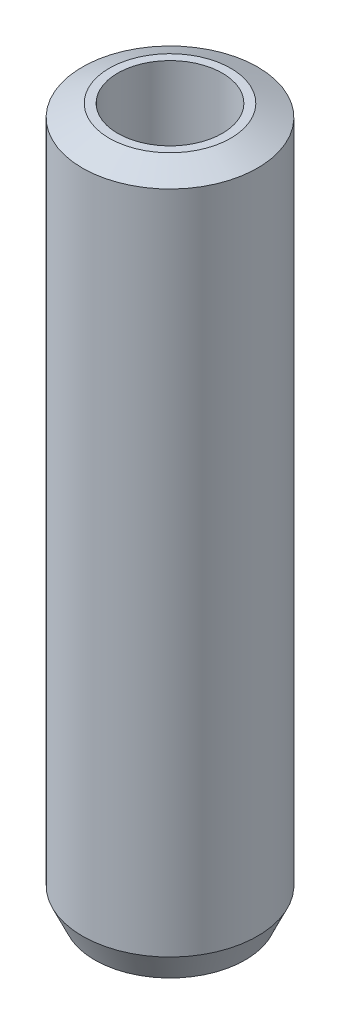
ISO-10303-21;
HEADER;
FILE_DESCRIPTION(('STEP AP214'),'2;1');
FILE_NAME('part.step','',(''),(''),'','','');
FILE_SCHEMA(('AUTOMOTIVE_DESIGN { 1 0 10303 214 1 1 1 1 }'));
ENDSEC;
DATA;
#1=APPLICATION_CONTEXT('core data for automotive mechanical design processes');
#2=APPLICATION_PROTOCOL_DEFINITION('international standard','automotive_design',2000,#1);
#3=PRODUCT_CONTEXT('',#1,'mechanical');
#4=PRODUCT('Part','Part','',(#3));
#5=PRODUCT_RELATED_PRODUCT_CATEGORY('part','',(#4));
#6=PRODUCT_DEFINITION_FORMATION('','',#4);
#7=PRODUCT_DEFINITION_CONTEXT('part definition',#1,'design');
#8=PRODUCT_DEFINITION('design','',#6,#7);
#9=PRODUCT_DEFINITION_SHAPE('','',#8);
#10=(LENGTH_UNIT() NAMED_UNIT(*) SI_UNIT(.MILLI.,.METRE.));
#11=(NAMED_UNIT(*) PLANE_ANGLE_UNIT() SI_UNIT($,.RADIAN.));
#12=(NAMED_UNIT(*) SI_UNIT($,.STERADIAN.) SOLID_ANGLE_UNIT());
#13=UNCERTAINTY_MEASURE_WITH_UNIT(LENGTH_MEASURE(1.E-05),#10,'distance_accuracy_value','');
#14=(GEOMETRIC_REPRESENTATION_CONTEXT(3) GLOBAL_UNCERTAINTY_ASSIGNED_CONTEXT((#13)) GLOBAL_UNIT_ASSIGNED_CONTEXT((#10,
#11,#12)) REPRESENTATION_CONTEXT('',''));
#15=CARTESIAN_POINT('',(0.,0.,0.));
#16=DIRECTION('',(0.,0.,1.));
#17=DIRECTION('',(1.,0.,0.));
#18=AXIS2_PLACEMENT_3D('',#15,#16,#17);
#19=CARTESIAN_POINT('',(0.,301.515304557621,0.));
#20=DIRECTION('',(0.,-1.,0.));
#21=DIRECTION('',(0.,0.,-1.));
#22=AXIS2_PLACEMENT_3D('',#19,#20,#21);
#23=CYLINDRICAL_SURFACE('',#22,37.5);
#24=CARTESIAN_POINT('',(0.,296.228267570941,0.));
#25=DIRECTION('',(0.,1.,0.));
#26=DIRECTION('',(0.,0.,1.));
#27=AXIS2_PLACEMENT_3D('',#24,#25,#26);
#28=CIRCLE('',#27,37.5);
#29=CARTESIAN_POINT('',(0.,296.228267570941,37.5));
#30=VERTEX_POINT('',#29);
#31=EDGE_CURVE('E50',#30,#30,#28,.F.);
#32=ORIENTED_EDGE('',*,*,#31,.T.);
#33=EDGE_LOOP('',(#32));
#34=FACE_BOUND('',#33,.T.);
#35=CARTESIAN_POINT('',(0.,11.516406954369,0.));
#36=DIRECTION('',(0.,1.,0.));
#37=DIRECTION('',(0.,0.,1.));
#38=AXIS2_PLACEMENT_3D('',#35,#36,#37);
#39=CIRCLE('',#38,37.5);
#40=CARTESIAN_POINT('',(0.,11.516406954369,37.5));
#41=VERTEX_POINT('',#40);
#42=EDGE_CURVE('E51',#41,#41,#39,.T.);
#43=ORIENTED_EDGE('',*,*,#42,.T.);
#44=EDGE_LOOP('',(#43));
#45=FACE_BOUND('',#44,.T.);
#46=ADVANCED_FACE('F39',(#34,#45),#23,.T.);
#47=CARTESIAN_POINT('',(0.,301.515304557621,0.));
#48=DIRECTION('',(0.,1.,0.));
#49=DIRECTION('',(0.,0.,1.));
#50=AXIS2_PLACEMENT_3D('',#47,#48,#49);
#51=PLANE('',#50);
#52=CARTESIAN_POINT('',(0.,301.515304557621,0.));
#53=DIRECTION('',(0.,1.,0.));
#54=DIRECTION('',(0.,0.,1.));
#55=AXIS2_PLACEMENT_3D('',#52,#53,#54);
#56=CIRCLE('',#55,25.9835930456313);
#57=CARTESIAN_POINT('',(0.,301.515304557621,25.9835930456313));
#58=VERTEX_POINT('',#57);
#59=EDGE_CURVE('E54',#58,#58,#56,.T.);
#60=ORIENTED_EDGE('',*,*,#59,.T.);
#61=EDGE_LOOP('',(#60));
#62=FACE_BOUND('',#61,.T.);
#63=CARTESIAN_POINT('',(0.,301.515304557621,0.));
#64=DIRECTION('',(0.,1.,0.));
#65=DIRECTION('',(0.,0.,1.));
#66=AXIS2_PLACEMENT_3D('',#63,#64,#65);
#67=CIRCLE('',#66,22.3755580265607);
#68=CARTESIAN_POINT('',(0.,301.515304557621,22.3755580265607));
#69=VERTEX_POINT('',#68);
#70=EDGE_CURVE('E58',#69,#69,#67,.T.);
#71=ORIENTED_EDGE('',*,*,#70,.F.);
#72=EDGE_LOOP('',(#71));
#73=FACE_BOUND('',#72,.T.);
#74=ADVANCED_FACE('F69',(#62,#73),#51,.T.);
#75=CARTESIAN_POINT('',(0.,0.,0.));
#76=DIRECTION('',(0.,1.,0.));
#77=DIRECTION('',(0.,0.,1.));
#78=AXIS2_PLACEMENT_3D('',#75,#76,#77);
#79=PLANE('',#78);
#80=CARTESIAN_POINT('',(0.,0.,0.));
#81=DIRECTION('',(0.,1.,0.));
#82=DIRECTION('',(0.,0.,1.));
#83=AXIS2_PLACEMENT_3D('',#80,#81,#82);
#84=CIRCLE('',#83,32.2129630133191);
#85=CARTESIAN_POINT('',(0.,0.,32.2129630133191));
#86=VERTEX_POINT('',#85);
#87=EDGE_CURVE('E10',#86,#86,#84,.F.);
#88=ORIENTED_EDGE('',*,*,#87,.T.);
#89=EDGE_LOOP('',(#88));
#90=FACE_BOUND('',#89,.T.);
#91=CARTESIAN_POINT('',(0.,0.,0.));
#92=DIRECTION('',(0.,1.,0.));
#93=DIRECTION('',(0.,0.,1.));
#94=AXIS2_PLACEMENT_3D('',#91,#92,#93);
#95=CIRCLE('',#94,22.3755580265607);
#96=CARTESIAN_POINT('',(0.,0.,22.3755580265607));
#97=VERTEX_POINT('',#96);
#98=EDGE_CURVE('E63',#97,#97,#95,.T.);
#99=ORIENTED_EDGE('',*,*,#98,.T.);
#100=EDGE_LOOP('',(#99));
#101=FACE_BOUND('',#100,.T.);
#102=ADVANCED_FACE('F75',(#90,#101),#79,.F.);
#103=CARTESIAN_POINT('',(0.,301.515304557621,0.));
#104=DIRECTION('',(0.,-1.,0.));
#105=DIRECTION('',(0.,0.,-1.));
#106=AXIS2_PLACEMENT_3D('',#103,#104,#105);
#107=CYLINDRICAL_SURFACE('',#106,22.3755580265607);
#108=ORIENTED_EDGE('',*,*,#70,.T.);
#109=EDGE_LOOP('',(#108));
#110=FACE_BOUND('',#109,.T.);
#111=ORIENTED_EDGE('',*,*,#98,.F.);
#112=EDGE_LOOP('',(#111));
#113=FACE_BOUND('',#112,.T.);
#114=ADVANCED_FACE('F70',(#110,#113),#107,.F.);
#115=CARTESIAN_POINT('',(0.,301.515304557621,0.));
#116=DIRECTION('',(0.,-1.,0.));
#117=DIRECTION('',(0.,0.,-1.));
#118=AXIS2_PLACEMENT_3D('',#115,#116,#117);
#119=CONICAL_SURFACE('',#118,25.9835930456313,1.14041109022064);
#120=ORIENTED_EDGE('',*,*,#31,.F.);
#121=EDGE_LOOP('',(#120));
#122=FACE_BOUND('',#121,.T.);
#123=ORIENTED_EDGE('',*,*,#59,.F.);
#124=EDGE_LOOP('',(#123));
#125=FACE_BOUND('',#124,.T.);
#126=ADVANCED_FACE('F81',(#122,#125),#119,.T.);
#127=CARTESIAN_POINT('',(0.,11.516406954369,0.));
#128=DIRECTION('',(0.,1.,0.));
#129=DIRECTION('',(0.,0.,1.));
#130=AXIS2_PLACEMENT_3D('',#127,#128,#129);
#131=CONICAL_SURFACE('',#130,37.5,0.430385236574257);
#132=CARTESIAN_POINT('',(0.,0.,32.2129630133191));
#133=CARTESIAN_POINT('',(0.,0.119962572441342,32.2680363152637));
#134=CARTESIAN_POINT('',(0.,0.239925144882686,32.3231096172083));
#135=CARTESIAN_POINT('',(0.,0.479850289765374,32.4332562210975));
#136=CARTESIAN_POINT('',(0.,0.599812862206717,32.4883295230421));
#137=CARTESIAN_POINT('',(0.,0.839738007089405,32.5984761269313));
#138=CARTESIAN_POINT('',(0.,0.959700579530749,32.6535494288759));
#139=CARTESIAN_POINT('',(0.,1.19962572441344,32.7636960327651));
#140=CARTESIAN_POINT('',(0.,1.31958829685478,32.8187693347097));
#141=CARTESIAN_POINT('',(0.,1.55951344173747,32.9289159385988));
#142=CARTESIAN_POINT('',(0.,1.67947601417881,32.9839892405434));
#143=CARTESIAN_POINT('',(0.,1.9194011590615,33.0941358444326));
#144=CARTESIAN_POINT('',(0.,2.03936373150284,33.1492091463772));
#145=CARTESIAN_POINT('',(0.,2.27928887638553,33.2593557502664));
#146=CARTESIAN_POINT('',(0.,2.39925144882688,33.314429052211));
#147=CARTESIAN_POINT('',(0.,2.63917659370956,33.4245756561002));
#148=CARTESIAN_POINT('',(0.,2.75913916615091,33.4796489580448));
#149=CARTESIAN_POINT('',(0.,2.99906431103359,33.5897955619339));
#150=CARTESIAN_POINT('',(0.,3.11902688347494,33.6448688638785));
#151=CARTESIAN_POINT('',(0.,3.35895202835763,33.7550154677677));
#152=CARTESIAN_POINT('',(0.,3.47891460079897,33.8100887697123));
#153=CARTESIAN_POINT('',(0.,3.71883974568166,33.9202353736015));
#154=CARTESIAN_POINT('',(0.,3.838802318123,33.9753086755461));
#155=CARTESIAN_POINT('',(0.,4.07872746300569,34.0854552794353));
#156=CARTESIAN_POINT('',(0.,4.19869003544703,34.1405285813799));
#157=CARTESIAN_POINT('',(0.,4.43861518032972,34.2506751852691));
#158=CARTESIAN_POINT('',(0.,4.55857775277106,34.3057484872136));
#159=CARTESIAN_POINT('',(0.,4.79850289765375,34.4158950911028));
#160=CARTESIAN_POINT('',(0.,4.9184654700951,34.4709683930474));
#161=CARTESIAN_POINT('',(0.,5.15839061497778,34.5811149969366));
#162=CARTESIAN_POINT('',(0.,5.27835318741913,34.6361882988812));
#163=CARTESIAN_POINT('',(0.,5.51827833230181,34.7463349027704));
#164=CARTESIAN_POINT('',(0.,5.63824090474316,34.801408204715));
#165=CARTESIAN_POINT('',(0.,5.87816604962585,34.9115548086042));
#166=CARTESIAN_POINT('',(0.,5.99812862206719,34.9666281105488));
#167=CARTESIAN_POINT('',(0.,6.23805376694988,35.0767747144379));
#168=CARTESIAN_POINT('',(0.,6.35801633939122,35.1318480163825));
#169=CARTESIAN_POINT('',(0.,6.59794148427391,35.2419946202717));
#170=CARTESIAN_POINT('',(0.,6.71790405671525,35.2970679222163));
#171=CARTESIAN_POINT('',(0.,6.95782920159794,35.4072145261055));
#172=CARTESIAN_POINT('',(0.,7.07779177403928,35.4622878280501));
#173=CARTESIAN_POINT('',(0.,7.31771691892197,35.5724344319393));
#174=CARTESIAN_POINT('',(0.,7.43767949136332,35.6275077338839));
#175=CARTESIAN_POINT('',(0.,7.677604636246,35.737654337773));
#176=CARTESIAN_POINT('',(0.,7.79756720868735,35.7927276397176));
#177=CARTESIAN_POINT('',(0.,8.03749235357003,35.9028742436068));
#178=CARTESIAN_POINT('',(0.,8.15745492601138,35.9579475455514));
#179=CARTESIAN_POINT('',(0.,8.39738007089407,36.0680941494406));
#180=CARTESIAN_POINT('',(0.,8.51734264333541,36.1231674513852));
#181=CARTESIAN_POINT('',(0.,8.7572677882181,36.2333140552744));
#182=CARTESIAN_POINT('',(0.,8.87723036065944,36.288387357219));
#183=CARTESIAN_POINT('',(0.,9.11715550554213,36.3985339611082));
#184=CARTESIAN_POINT('',(0.,9.23711807798347,36.4536072630528));
#185=CARTESIAN_POINT('',(0.,9.47704322286616,36.5637538669419));
#186=CARTESIAN_POINT('',(0.,9.59700579530751,36.6188271688865));
#187=CARTESIAN_POINT('',(0.,9.83693094019019,36.7289737727757));
#188=CARTESIAN_POINT('',(0.,9.95689351263154,36.7840470747203));
#189=CARTESIAN_POINT('',(0.,10.1968186575142,36.8941936786095));
#190=CARTESIAN_POINT('',(0.,10.3167812299556,36.9492669805541));
#191=CARTESIAN_POINT('',(0.,10.5567063748383,37.0594135844433));
#192=CARTESIAN_POINT('',(0.,10.6766689472796,37.1144868863879));
#193=CARTESIAN_POINT('',(0.,10.9165940921623,37.224633490277));
#194=CARTESIAN_POINT('',(0.,11.0365566646036,37.2797067922216));
#195=CARTESIAN_POINT('',(0.,11.2764818094863,37.3898533961108));
#196=CARTESIAN_POINT('',(0.,11.3964443819277,37.4449266980554));
#197=CARTESIAN_POINT('',(0.,11.516406954369,37.5));
#198=B_SPLINE_CURVE_WITH_KNOTS('',3,(#132,#133,#134,#135,#136,#137,#138,#139,#140,#141,#142,
#143,#144,#145,#146,#147,#148,#149,#150,#151,#152,#153,#154,#155,#156,#157,#158,#159,#160,#161,
#162,#163,#164,#165,#166,#167,#168,#169,#170,#171,#172,#173,#174,#175,#176,#177,#178,#179,#180,
#181,#182,#183,#184,#185,#186,#187,#188,#189,#190,#191,#192,#193,#194,#195,#196,#197),
.UNSPECIFIED.,.F.,.F.,(4,2,2,2,2,2,2,2,2,2,2,2,2,2,2,2,2,2,2,2,2,2,2,2,2,2,2,2,2,2,2,2,4),(0.,
0.396000992883129,0.792001985766258,1.18800297864939,1.58400397153252,1.98000496441565,
2.37600595729878,2.77200695018191,3.16800794306503,3.56400893594817,3.96000992883129,
4.35601092171442,4.75201191459755,5.14801290748068,5.54401390036381,5.94001489324694,
6.33601588613007,6.7320168790132,7.12801787189633,7.52401886477946,7.92001985766259,
8.31602085054572,8.71202184342885,9.10802283631197,9.50402382919511,9.90002482207823,
10.2960258149614,10.6920268078445,11.0880278007276,11.4840287936107,11.8800297864939,
12.276030779377,12.6720317722601),.UNSPECIFIED.);
#199=EDGE_CURVE('BSEAM45',#86,#41,#198,.T.);
#200=ORIENTED_EDGE('',*,*,#87,.F.);
#201=ORIENTED_EDGE('',*,*,#42,.F.);
#202=ORIENTED_EDGE('',*,*,#199,.T.);
#203=ORIENTED_EDGE('',*,*,#199,.F.);
#204=EDGE_LOOP('',(#200,#202,#201,#203));
#205=FACE_BOUND('',#204,.T.);
#206=ADVANCED_FACE('F45',(#205),#131,.T.);
#207=CLOSED_SHELL('',(#46,#74,#102,#114,#126,#206));
#208=MANIFOLD_SOLID_BREP('B2',#207);
#209=ADVANCED_BREP_SHAPE_REPRESENTATION('',(#18,#208),#14);
#210=SHAPE_DEFINITION_REPRESENTATION(#9,#209);
ENDSEC;
END-ISO-10303-21;
